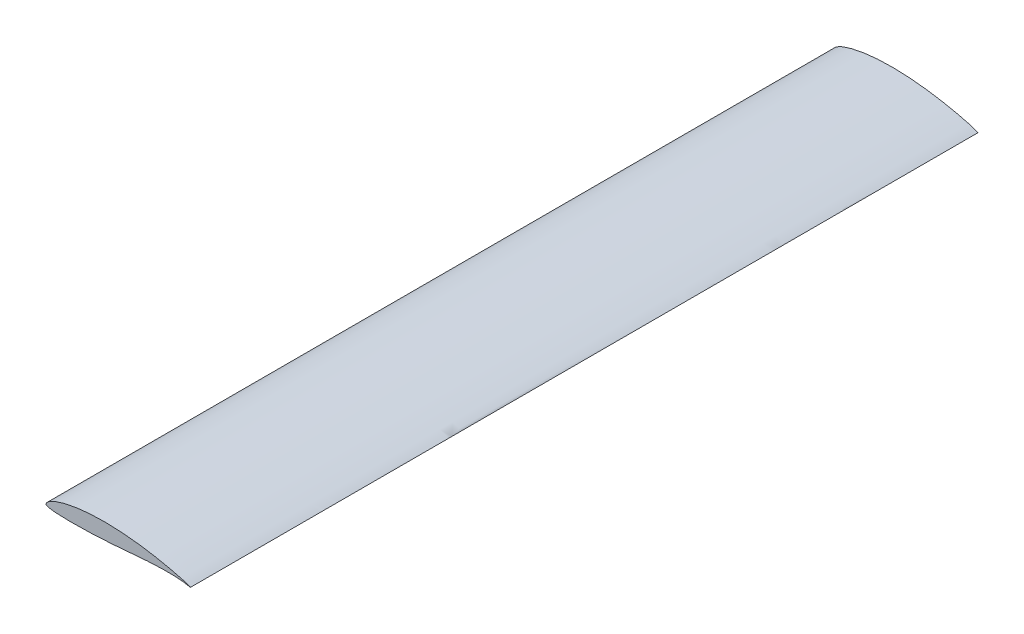
ISO-10303-21;
HEADER;
FILE_DESCRIPTION(('STEP AP214'),'2;1');
FILE_NAME('part.step','',(''),(''),'','','');
FILE_SCHEMA(('AUTOMOTIVE_DESIGN { 1 0 10303 214 1 1 1 1 }'));
ENDSEC;
DATA;
#1=APPLICATION_CONTEXT('core data for automotive mechanical design processes');
#2=APPLICATION_PROTOCOL_DEFINITION('international standard','automotive_design',2000,#1);
#3=PRODUCT_CONTEXT('',#1,'mechanical');
#4=PRODUCT('Part','Part','',(#3));
#5=PRODUCT_RELATED_PRODUCT_CATEGORY('part','',(#4));
#6=PRODUCT_DEFINITION_FORMATION('','',#4);
#7=PRODUCT_DEFINITION_CONTEXT('part definition',#1,'design');
#8=PRODUCT_DEFINITION('design','',#6,#7);
#9=PRODUCT_DEFINITION_SHAPE('','',#8);
#10=(LENGTH_UNIT() NAMED_UNIT(*) SI_UNIT(.MILLI.,.METRE.));
#11=(NAMED_UNIT(*) PLANE_ANGLE_UNIT() SI_UNIT($,.RADIAN.));
#12=(NAMED_UNIT(*) SI_UNIT($,.STERADIAN.) SOLID_ANGLE_UNIT());
#13=UNCERTAINTY_MEASURE_WITH_UNIT(LENGTH_MEASURE(1.E-05),#10,'distance_accuracy_value','');
#14=(GEOMETRIC_REPRESENTATION_CONTEXT(3) GLOBAL_UNCERTAINTY_ASSIGNED_CONTEXT((#13)) GLOBAL_UNIT_ASSIGNED_CONTEXT((#10,
#11,#12)) REPRESENTATION_CONTEXT('',''));
#15=CARTESIAN_POINT('',(0.,0.,0.));
#16=DIRECTION('',(0.,0.,1.));
#17=DIRECTION('',(1.,0.,0.));
#18=AXIS2_PLACEMENT_3D('',#15,#16,#17);
#19=CARTESIAN_POINT('',(220.,0.,1200.));
#20=CARTESIAN_POINT('',(219.998135988228,0.019122612769064,1200.));
#21=CARTESIAN_POINT('',(218.563925507481,0.543091868487008,1200.));
#22=CARTESIAN_POINT('',(217.202877024419,1.19516194860827,1200.));
#23=CARTESIAN_POINT('',(214.03194204329,2.45700266411012,1200.));
#24=CARTESIAN_POINT('',(210.151500293816,3.72567555091357,1200.));
#25=CARTESIAN_POINT('',(205.115001186407,5.1598239248622,1200.));
#26=CARTESIAN_POINT('',(199.149888904466,6.7120985321943,1200.));
#27=CARTESIAN_POINT('',(192.261767895211,8.3704414084698,1200.));
#28=CARTESIAN_POINT('',(184.567092503771,10.0950168410725,1200.));
#29=CARTESIAN_POINT('',(176.157547086886,11.8481097501242,1200.));
#30=CARTESIAN_POINT('',(167.144050476288,13.5891104837566,1200.));
#31=CARTESIAN_POINT('',(157.63138877999,15.2612937480579,1200.));
#32=CARTESIAN_POINT('',(147.724085726131,16.8116239450345,1200.));
#33=CARTESIAN_POINT('',(137.514484092647,18.1798754846856,1200.));
#34=CARTESIAN_POINT('',(127.090971309379,19.3175677708221,1200.));
#35=CARTESIAN_POINT('',(116.547260472966,20.2113643203167,1200.));
#36=CARTESIAN_POINT('',(105.976186710087,20.8431211680212,1200.));
#37=CARTESIAN_POINT('',(95.4746480097475,21.1854190389238,1200.));
#38=CARTESIAN_POINT('',(85.1348309623493,21.2321153849877,1200.));
#39=CARTESIAN_POINT('',(75.0480096675265,20.9840461362686,1200.));
#40=CARTESIAN_POINT('',(65.2988334378305,20.4308583052565,1200.));
#41=CARTESIAN_POINT('',(55.9696598656602,19.5865790313892,1200.));
#42=CARTESIAN_POINT('',(47.1377607097177,18.4717810207035,1200.));
#43=CARTESIAN_POINT('',(38.8783541383138,17.1212952055974,1200.));
#44=CARTESIAN_POINT('',(31.2670264700617,15.5525474630298,1200.));
#45=CARTESIAN_POINT('',(24.3698269001131,13.8158026249487,1200.));
#46=CARTESIAN_POINT('',(18.2510153762976,11.9324740729712,1200.));
#47=CARTESIAN_POINT('',(12.9619953142987,9.95369233646629,1200.));
#48=CARTESIAN_POINT('',(8.54278422916862,7.92013349261401,1200.));
#49=CARTESIAN_POINT('',(5.03312390623154,5.88366431958662,1200.));
#50=CARTESIAN_POINT('',(2.41280046582108,3.86320115913454,1200.));
#51=CARTESIAN_POINT('',(0.795770018265609,1.97683495763825,1200.));
#52=CARTESIAN_POINT('',(0.0193147651120914,0.644286641470641,1200.));
#53=CARTESIAN_POINT('',(-0.0132032664969198,-0.382736012280879,1200.));
#54=CARTESIAN_POINT('',(0.652064302674449,-1.49605782529591,1200.));
#55=CARTESIAN_POINT('',(2.84544830651274,-2.14258628387714,1200.));
#56=CARTESIAN_POINT('',(5.95464356862865,-2.98440306541852,1200.));
#57=CARTESIAN_POINT('',(10.312781637031,-3.58446605744093,1200.));
#58=CARTESIAN_POINT('',(15.7417240562825,-4.10087286330419,1200.));
#59=CARTESIAN_POINT('',(22.2367092950032,-4.45687260956608,1200.));
#60=CARTESIAN_POINT('',(29.709916282686,-4.67595721530044,1200.));
#61=CARTESIAN_POINT('',(38.085618784261,-4.75852280035206,1200.));
#62=CARTESIAN_POINT('',(47.2677814503504,-4.70161160855275,1200.));
#63=CARTESIAN_POINT('',(57.1538412074071,-4.51149073553067,1200.));
#64=CARTESIAN_POINT('',(67.6354507095059,-4.1888100224987,1200.));
#65=CARTESIAN_POINT('',(78.5993602079246,-3.7203684485883,1200.));
#66=CARTESIAN_POINT('',(89.93435705826,-3.11830430456559,1200.));
#67=CARTESIAN_POINT('',(101.539496695476,-2.35725809158935,1200.));
#68=CARTESIAN_POINT('',(113.340300931578,-1.41480010275125,1200.));
#69=CARTESIAN_POINT('',(125.265386020178,-0.326588307484731,1200.));
#70=CARTESIAN_POINT('',(137.222746021077,0.727046983470637,1200.));
#71=CARTESIAN_POINT('',(149.057254793242,1.66339154029184,1200.));
#72=CARTESIAN_POINT('',(160.582212641525,2.41121224993218,1200.));
#73=CARTESIAN_POINT('',(171.603566779482,2.91625239875386,1200.));
#74=CARTESIAN_POINT('',(181.921027750833,3.1568990726373,1200.));
#75=CARTESIAN_POINT('',(191.351550467613,3.11146062772809,1200.));
#76=CARTESIAN_POINT('',(199.668522117973,2.81379438215721,1200.));
#77=CARTESIAN_POINT('',(206.782546863184,2.25122328417801,1200.));
#78=CARTESIAN_POINT('',(212.210903629221,1.58255747404349,1200.));
#79=CARTESIAN_POINT('',(216.562666492359,0.757675809398578,1200.));
#80=CARTESIAN_POINT('',(218.315737754805,0.434906763254223,1200.));
#81=CARTESIAN_POINT('',(220.00196894976,-0.0201991555943604,1200.));
#82=CARTESIAN_POINT('',(220.,0.,1200.));
#83=B_SPLINE_CURVE_WITH_KNOTS('',3,(#19,#20,#21,#22,#23,#24,#25,#26,#27,#28,#29,#30,#31,#32,#33,
#34,#35,#36,#37,#38,#39,#40,#41,#42,#43,#44,#45,#46,#47,#48,#49,#50,#51,#52,#53,#54,#55,#56,#57,
#58,#59,#60,#61,#62,#63,#64,#65,#66,#67,#68,#69,#70,#71,#72,#73,#74,#75,#76,#77,#78,#79,#80,#81,
#82),.UNSPECIFIED.,.T.,.F.,(4,1,1,1,1,1,1,1,1,1,1,1,1,1,1,1,1,1,1,1,1,1,1,1,1,1,1,1,1,1,1,1,1,1,
1,1,1,1,1,1,1,1,1,1,1,1,1,1,1,1,1,1,1,1,1,1,1,1,1,1,1,4),(0.,0.00169352365364152,
0.00639544747949773,0.0134616508959297,0.0227535749736498,0.0343673071517183,0.0481910226954883,
0.064031392481717,0.0816806172414246,0.100894124121338,0.121431793819588,0.143025453493653,
0.165434010835678,0.188439038764568,0.211855124404938,0.235496289450679,0.259143745164547,
0.282614908314604,0.30570154453718,0.328231583662434,0.350030433806964,0.370943883213179,
0.390816528552158,0.409505873078083,0.426856550273814,0.442733384525219,0.457018387509694,
0.469615069942757,0.480449695456552,0.489471860268703,0.496730301180352,0.502329146614106,
0.506255660132997,0.506441944995434,0.509181515928635,0.513913846214958,0.521178418676577,
0.530944156675701,0.543144508951146,0.557669673966592,0.574383525920582,0.593109554408619,
0.613638211877394,0.635743557157375,0.659184094922804,0.683713689413154,0.709075753928382,
0.735036066440786,0.761429738598203,0.7881837663948,0.815056829999432,0.84164476376198,
0.867513560484753,0.892232408519161,0.915363656349594,0.936485324642644,0.955199831872162,
0.971104187426938,0.983751025641108,0.992812817585366,0.998211136302568,1.),.UNSPECIFIED.);
#84=DIRECTION('',(0.,0.,-1.));
#85=VECTOR('',#84,1.);
#86=SURFACE_OF_LINEAR_EXTRUSION('',#83,#85);
#87=CARTESIAN_POINT('',(220.,0.,1200.));
#88=VERTEX_POINT('',#87);
#89=EDGE_CURVE('E10',#88,#88,#83,.T.);
#90=ORIENTED_EDGE('',*,*,#89,.F.);
#91=EDGE_LOOP('',(#90));
#92=FACE_BOUND('',#91,.T.);
#93=CARTESIAN_POINT('',(220.,0.,0.));
#94=CARTESIAN_POINT('',(219.998135988228,0.019122612769064,0.));
#95=CARTESIAN_POINT('',(218.563925507481,0.543091868487008,0.));
#96=CARTESIAN_POINT('',(217.202877024419,1.19516194860827,0.));
#97=CARTESIAN_POINT('',(214.03194204329,2.45700266411012,0.));
#98=CARTESIAN_POINT('',(210.151500293816,3.72567555091357,0.));
#99=CARTESIAN_POINT('',(205.115001186407,5.1598239248622,0.));
#100=CARTESIAN_POINT('',(199.149888904466,6.7120985321943,0.));
#101=CARTESIAN_POINT('',(192.261767895211,8.3704414084698,0.));
#102=CARTESIAN_POINT('',(184.567092503771,10.0950168410725,0.));
#103=CARTESIAN_POINT('',(176.157547086886,11.8481097501242,0.));
#104=CARTESIAN_POINT('',(167.144050476288,13.5891104837566,0.));
#105=CARTESIAN_POINT('',(157.63138877999,15.2612937480579,0.));
#106=CARTESIAN_POINT('',(147.724085726131,16.8116239450345,0.));
#107=CARTESIAN_POINT('',(137.514484092647,18.1798754846856,0.));
#108=CARTESIAN_POINT('',(127.090971309379,19.3175677708221,0.));
#109=CARTESIAN_POINT('',(116.547260472966,20.2113643203167,0.));
#110=CARTESIAN_POINT('',(105.976186710087,20.8431211680212,0.));
#111=CARTESIAN_POINT('',(95.4746480097475,21.1854190389238,0.));
#112=CARTESIAN_POINT('',(85.1348309623493,21.2321153849877,0.));
#113=CARTESIAN_POINT('',(75.0480096675265,20.9840461362686,0.));
#114=CARTESIAN_POINT('',(65.2988334378305,20.4308583052565,0.));
#115=CARTESIAN_POINT('',(55.9696598656602,19.5865790313892,0.));
#116=CARTESIAN_POINT('',(47.1377607097177,18.4717810207035,0.));
#117=CARTESIAN_POINT('',(38.8783541383138,17.1212952055974,0.));
#118=CARTESIAN_POINT('',(31.2670264700617,15.5525474630298,0.));
#119=CARTESIAN_POINT('',(24.3698269001131,13.8158026249487,0.));
#120=CARTESIAN_POINT('',(18.2510153762976,11.9324740729712,0.));
#121=CARTESIAN_POINT('',(12.9619953142987,9.95369233646629,0.));
#122=CARTESIAN_POINT('',(8.54278422916862,7.92013349261401,0.));
#123=CARTESIAN_POINT('',(5.03312390623154,5.88366431958662,0.));
#124=CARTESIAN_POINT('',(2.41280046582108,3.86320115913454,0.));
#125=CARTESIAN_POINT('',(0.795770018265609,1.97683495763825,0.));
#126=CARTESIAN_POINT('',(0.0193147651120914,0.644286641470641,0.));
#127=CARTESIAN_POINT('',(-0.0132032664969198,-0.382736012280879,0.));
#128=CARTESIAN_POINT('',(0.652064302674449,-1.49605782529591,0.));
#129=CARTESIAN_POINT('',(2.84544830651274,-2.14258628387714,0.));
#130=CARTESIAN_POINT('',(5.95464356862865,-2.98440306541852,0.));
#131=CARTESIAN_POINT('',(10.312781637031,-3.58446605744093,0.));
#132=CARTESIAN_POINT('',(15.7417240562825,-4.10087286330419,0.));
#133=CARTESIAN_POINT('',(22.2367092950032,-4.45687260956608,0.));
#134=CARTESIAN_POINT('',(29.709916282686,-4.67595721530044,0.));
#135=CARTESIAN_POINT('',(38.085618784261,-4.75852280035206,0.));
#136=CARTESIAN_POINT('',(47.2677814503504,-4.70161160855275,0.));
#137=CARTESIAN_POINT('',(57.1538412074071,-4.51149073553067,0.));
#138=CARTESIAN_POINT('',(67.6354507095059,-4.1888100224987,0.));
#139=CARTESIAN_POINT('',(78.5993602079246,-3.7203684485883,0.));
#140=CARTESIAN_POINT('',(89.93435705826,-3.11830430456559,0.));
#141=CARTESIAN_POINT('',(101.539496695476,-2.35725809158935,0.));
#142=CARTESIAN_POINT('',(113.340300931578,-1.41480010275125,0.));
#143=CARTESIAN_POINT('',(125.265386020178,-0.326588307484731,0.));
#144=CARTESIAN_POINT('',(137.222746021077,0.727046983470637,0.));
#145=CARTESIAN_POINT('',(149.057254793242,1.66339154029184,0.));
#146=CARTESIAN_POINT('',(160.582212641525,2.41121224993218,0.));
#147=CARTESIAN_POINT('',(171.603566779482,2.91625239875386,0.));
#148=CARTESIAN_POINT('',(181.921027750833,3.1568990726373,0.));
#149=CARTESIAN_POINT('',(191.351550467613,3.11146062772809,0.));
#150=CARTESIAN_POINT('',(199.668522117973,2.81379438215721,0.));
#151=CARTESIAN_POINT('',(206.782546863184,2.25122328417801,0.));
#152=CARTESIAN_POINT('',(212.210903629221,1.58255747404349,0.));
#153=CARTESIAN_POINT('',(216.562666492359,0.757675809398578,0.));
#154=CARTESIAN_POINT('',(218.315737754805,0.434906763254223,0.));
#155=CARTESIAN_POINT('',(220.00196894976,-0.0201991555943604,0.));
#156=CARTESIAN_POINT('',(220.,0.,0.));
#157=B_SPLINE_CURVE_WITH_KNOTS('',3,(#93,#94,#95,#96,#97,#98,#99,#100,#101,#102,#103,#104,#105,
#106,#107,#108,#109,#110,#111,#112,#113,#114,#115,#116,#117,#118,#119,#120,#121,#122,#123,#124,
#125,#126,#127,#128,#129,#130,#131,#132,#133,#134,#135,#136,#137,#138,#139,#140,#141,#142,#143,
#144,#145,#146,#147,#148,#149,#150,#151,#152,#153,#154,#155,#156),.UNSPECIFIED.,.T.,.F.,(4,1,1,
1,1,1,1,1,1,1,1,1,1,1,1,1,1,1,1,1,1,1,1,1,1,1,1,1,1,1,1,1,1,1,1,1,1,1,1,1,1,1,1,1,1,1,1,1,1,1,1,
1,1,1,1,1,1,1,1,1,1,4),(0.,0.00169352365364152,0.00639544747949773,0.0134616508959297,
0.0227535749736498,0.0343673071517183,0.0481910226954883,0.064031392481717,0.0816806172414246,
0.100894124121338,0.121431793819588,0.143025453493653,0.165434010835678,0.188439038764568,
0.211855124404938,0.235496289450679,0.259143745164547,0.282614908314604,0.30570154453718,
0.328231583662434,0.350030433806964,0.370943883213179,0.390816528552158,0.409505873078083,
0.426856550273814,0.442733384525219,0.457018387509694,0.469615069942757,0.480449695456552,
0.489471860268703,0.496730301180352,0.502329146614106,0.506255660132997,0.506441944995434,
0.509181515928635,0.513913846214958,0.521178418676577,0.530944156675701,0.543144508951146,
0.557669673966592,0.574383525920582,0.593109554408619,0.613638211877394,0.635743557157375,
0.659184094922804,0.683713689413154,0.709075753928382,0.735036066440786,0.761429738598203,
0.7881837663948,0.815056829999432,0.84164476376198,0.867513560484753,0.892232408519161,
0.915363656349594,0.936485324642644,0.955199831872162,0.971104187426938,0.983751025641108,
0.992812817585366,0.998211136302568,1.),.UNSPECIFIED.);
#158=CARTESIAN_POINT('',(220.,0.,0.));
#159=VERTEX_POINT('',#158);
#160=EDGE_CURVE('E41',#159,#159,#157,.T.);
#161=ORIENTED_EDGE('',*,*,#160,.T.);
#162=EDGE_LOOP('',(#161));
#163=FACE_BOUND('',#162,.T.);
#164=ADVANCED_FACE('F37',(#92,#163),#86,.F.);
#165=CARTESIAN_POINT('',(1.32270829658564,2.55442427723826,1200.));
#166=DIRECTION('',(0.,0.,-1.));
#167=DIRECTION('',(-1.,0.,0.));
#168=AXIS2_PLACEMENT_3D('',#165,#166,#167);
#169=PLANE('',#168);
#170=ORIENTED_EDGE('',*,*,#89,.T.);
#171=EDGE_LOOP('',(#170));
#172=FACE_BOUND('',#171,.T.);
#173=ADVANCED_FACE('F60',(#172),#169,.F.);
#174=CARTESIAN_POINT('',(1.32270829658564,2.55442427723826,0.));
#175=DIRECTION('',(0.,0.,-1.));
#176=DIRECTION('',(-1.,0.,0.));
#177=AXIS2_PLACEMENT_3D('',#174,#175,#176);
#178=PLANE('',#177);
#179=ORIENTED_EDGE('',*,*,#160,.F.);
#180=EDGE_LOOP('',(#179));
#181=FACE_BOUND('',#180,.T.);
#182=ADVANCED_FACE('F58',(#181),#178,.T.);
#183=CLOSED_SHELL('',(#164,#173,#182));
#184=MANIFOLD_SOLID_BREP('B2',#183);
#185=ADVANCED_BREP_SHAPE_REPRESENTATION('',(#18,#184),#14);
#186=SHAPE_DEFINITION_REPRESENTATION(#9,#185);
ENDSEC;
END-ISO-10303-21;
